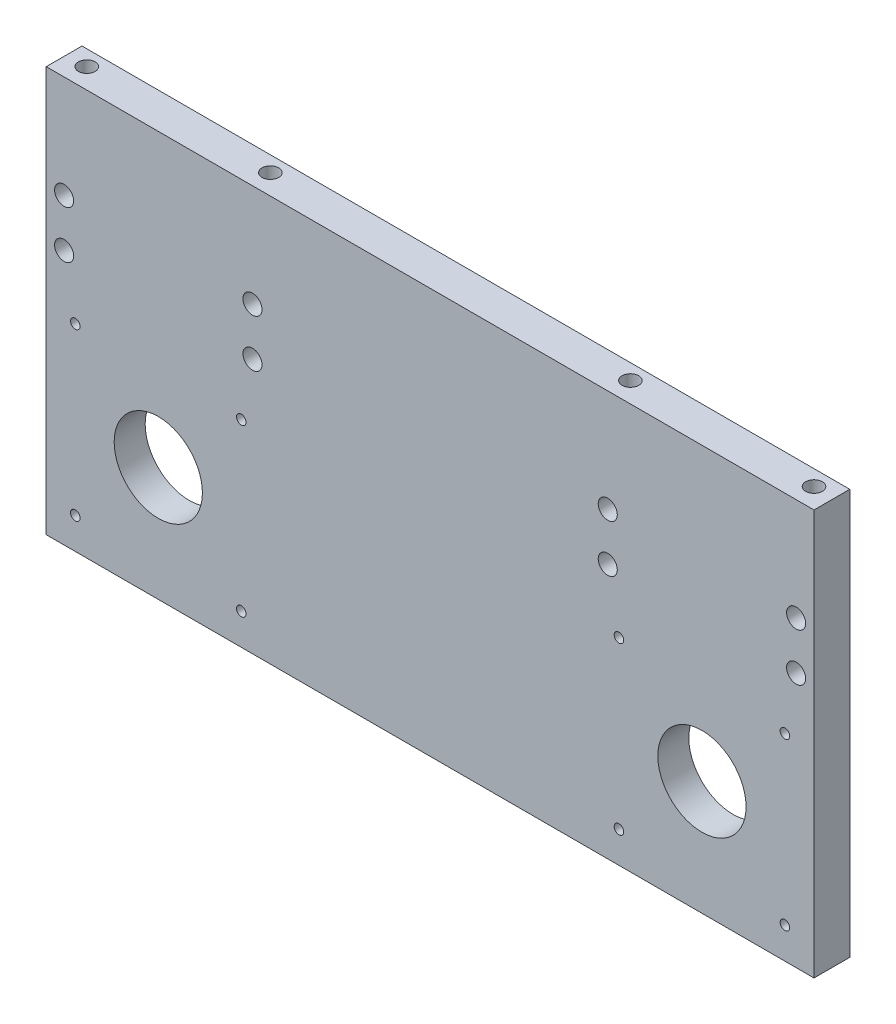
ISO-10303-21;
HEADER;
FILE_DESCRIPTION(('STEP AP214'),'2;1');
FILE_NAME('part.step','',(''),(''),'','','');
FILE_SCHEMA(('AUTOMOTIVE_DESIGN { 1 0 10303 214 1 1 1 1 }'));
ENDSEC;
DATA;
#1=APPLICATION_CONTEXT('core data for automotive mechanical design processes');
#2=APPLICATION_PROTOCOL_DEFINITION('international standard','automotive_design',2000,#1);
#3=PRODUCT_CONTEXT('',#1,'mechanical');
#4=PRODUCT('Part','Part','',(#3));
#5=PRODUCT_RELATED_PRODUCT_CATEGORY('part','',(#4));
#6=PRODUCT_DEFINITION_FORMATION('','',#4);
#7=PRODUCT_DEFINITION_CONTEXT('part definition',#1,'design');
#8=PRODUCT_DEFINITION('design','',#6,#7);
#9=PRODUCT_DEFINITION_SHAPE('','',#8);
#10=(LENGTH_UNIT() NAMED_UNIT(*) SI_UNIT(.MILLI.,.METRE.));
#11=(NAMED_UNIT(*) PLANE_ANGLE_UNIT() SI_UNIT($,.RADIAN.));
#12=(NAMED_UNIT(*) SI_UNIT($,.STERADIAN.) SOLID_ANGLE_UNIT());
#13=UNCERTAINTY_MEASURE_WITH_UNIT(LENGTH_MEASURE(1.E-05),#10,'distance_accuracy_value','');
#14=(GEOMETRIC_REPRESENTATION_CONTEXT(3) GLOBAL_UNCERTAINTY_ASSIGNED_CONTEXT((#13)) GLOBAL_UNIT_ASSIGNED_CONTEXT((#10,
#11,#12)) REPRESENTATION_CONTEXT('',''));
#15=CARTESIAN_POINT('',(0.,0.,0.));
#16=DIRECTION('',(0.,0.,1.));
#17=DIRECTION('',(1.,0.,0.));
#18=AXIS2_PLACEMENT_3D('',#15,#16,#17);
#19=CARTESIAN_POINT('',(-79.2,-2.27000000000004,-2.75));
#20=DIRECTION('',(0.,0.,1.));
#21=DIRECTION('',(1.,0.,0.));
#22=AXIS2_PLACEMENT_3D('',#19,#20,#21);
#23=CYLINDRICAL_SURFACE('',#22,2.);
#24=CARTESIAN_POINT('',(-79.2,-2.27000000000004,15.));
#25=DIRECTION('',(0.,0.,1.));
#26=DIRECTION('',(1.,0.,0.));
#27=AXIS2_PLACEMENT_3D('',#24,#25,#26);
#28=CIRCLE('',#27,2.);
#29=CARTESIAN_POINT('',(-77.2,-2.27000000000004,15.));
#30=VERTEX_POINT('',#29);
#31=EDGE_CURVE('E46',#30,#30,#28,.T.);
#32=ORIENTED_EDGE('',*,*,#31,.T.);
#33=EDGE_LOOP('',(#32));
#34=FACE_BOUND('',#33,.T.);
#35=CARTESIAN_POINT('',(-79.2,-2.27000000000004,0.));
#36=DIRECTION('',(0.,0.,1.));
#37=DIRECTION('',(1.,0.,0.));
#38=AXIS2_PLACEMENT_3D('',#35,#36,#37);
#39=CIRCLE('',#38,2.);
#40=CARTESIAN_POINT('',(-77.2,-2.27000000000004,0.));
#41=VERTEX_POINT('',#40);
#42=EDGE_CURVE('E11',#41,#41,#39,.T.);
#43=ORIENTED_EDGE('',*,*,#42,.F.);
#44=EDGE_LOOP('',(#43));
#45=FACE_BOUND('',#44,.T.);
#46=ADVANCED_FACE('F37',(#34,#45),#23,.F.);
#47=CARTESIAN_POINT('',(-148.8,-2.27000000000004,-2.75));
#48=DIRECTION('',(0.,0.,1.));
#49=DIRECTION('',(1.,0.,0.));
#50=AXIS2_PLACEMENT_3D('',#47,#48,#49);
#51=CYLINDRICAL_SURFACE('',#50,2.);
#52=CARTESIAN_POINT('',(-148.8,-2.27000000000004,15.));
#53=DIRECTION('',(0.,0.,1.));
#54=DIRECTION('',(1.,0.,0.));
#55=AXIS2_PLACEMENT_3D('',#52,#53,#54);
#56=CIRCLE('',#55,2.);
#57=CARTESIAN_POINT('',(-146.8,-2.27000000000004,15.));
#58=VERTEX_POINT('',#57);
#59=EDGE_CURVE('E246',#58,#58,#56,.T.);
#60=ORIENTED_EDGE('',*,*,#59,.T.);
#61=EDGE_LOOP('',(#60));
#62=FACE_BOUND('',#61,.T.);
#63=CARTESIAN_POINT('',(-148.8,-2.27000000000004,0.));
#64=DIRECTION('',(0.,0.,1.));
#65=DIRECTION('',(1.,0.,0.));
#66=AXIS2_PLACEMENT_3D('',#63,#64,#65);
#67=CIRCLE('',#66,2.);
#68=CARTESIAN_POINT('',(-146.8,-2.27000000000004,0.));
#69=VERTEX_POINT('',#68);
#70=EDGE_CURVE('E251',#69,#69,#67,.T.);
#71=ORIENTED_EDGE('',*,*,#70,.F.);
#72=EDGE_LOOP('',(#71));
#73=FACE_BOUND('',#72,.T.);
#74=ADVANCED_FACE('F287',(#62,#73),#51,.F.);
#75=CARTESIAN_POINT('',(-161.,-85.,15.));
#76=DIRECTION('',(1.,0.,0.));
#77=DIRECTION('',(0.,0.,-1.));
#78=AXIS2_PLACEMENT_3D('',#75,#76,#77);
#79=PLANE('',#78);
#80=DIRECTION('',(0.,-1.,0.));
#81=VECTOR('',#80,1.);
#82=CARTESIAN_POINT('',(-161.,-85.,0.));
#83=LINE('',#82,#81);
#84=CARTESIAN_POINT('',(-161.,85.,0.));
#85=VERTEX_POINT('',#84);
#86=CARTESIAN_POINT('',(-161.,-85.,0.));
#87=VERTEX_POINT('',#86);
#88=EDGE_CURVE('E232',#85,#87,#83,.T.);
#89=ORIENTED_EDGE('',*,*,#88,.T.);
#90=DIRECTION('',(0.,0.,-1.));
#91=VECTOR('',#90,1.);
#92=CARTESIAN_POINT('',(-161.,-85.,15.));
#93=LINE('',#92,#91);
#94=CARTESIAN_POINT('',(-161.,-85.,15.));
#95=VERTEX_POINT('',#94);
#96=EDGE_CURVE('E244',#95,#87,#93,.T.);
#97=ORIENTED_EDGE('',*,*,#96,.F.);
#98=DIRECTION('',(0.,-1.,0.));
#99=VECTOR('',#98,1.);
#100=CARTESIAN_POINT('',(-161.,-85.,15.));
#101=LINE('',#100,#99);
#102=CARTESIAN_POINT('',(-161.,85.,15.));
#103=VERTEX_POINT('',#102);
#104=EDGE_CURVE('E225',#103,#95,#101,.T.);
#105=ORIENTED_EDGE('',*,*,#104,.F.);
#106=DIRECTION('',(0.,0.,-1.));
#107=VECTOR('',#106,1.);
#108=CARTESIAN_POINT('',(-161.,85.,15.));
#109=LINE('',#108,#107);
#110=EDGE_CURVE('E231',#103,#85,#109,.T.);
#111=ORIENTED_EDGE('',*,*,#110,.T.);
#112=EDGE_LOOP('',(#89,#97,#105,#111));
#113=FACE_BOUND('',#112,.T.);
#114=ADVANCED_FACE('F292',(#113),#79,.F.);
#115=CARTESIAN_POINT('',(161.,-85.,15.));
#116=DIRECTION('',(0.,1.,0.));
#117=DIRECTION('',(-1.,0.,0.));
#118=AXIS2_PLACEMENT_3D('',#115,#116,#117);
#119=PLANE('',#118);
#120=DIRECTION('',(1.,0.,0.));
#121=VECTOR('',#120,1.);
#122=CARTESIAN_POINT('',(161.,-85.,0.));
#123=LINE('',#122,#121);
#124=CARTESIAN_POINT('',(161.,-85.,0.));
#125=VERTEX_POINT('',#124);
#126=EDGE_CURVE('E235',#87,#125,#123,.T.);
#127=ORIENTED_EDGE('',*,*,#126,.T.);
#128=DIRECTION('',(0.,0.,-1.));
#129=VECTOR('',#128,1.);
#130=CARTESIAN_POINT('',(161.,-85.,15.));
#131=LINE('',#130,#129);
#132=CARTESIAN_POINT('',(161.,-85.,15.));
#133=VERTEX_POINT('',#132);
#134=EDGE_CURVE('E242',#133,#125,#131,.T.);
#135=ORIENTED_EDGE('',*,*,#134,.F.);
#136=DIRECTION('',(1.,0.,0.));
#137=VECTOR('',#136,1.);
#138=CARTESIAN_POINT('',(161.,-85.,15.));
#139=LINE('',#138,#137);
#140=EDGE_CURVE('E87',#95,#133,#139,.T.);
#141=ORIENTED_EDGE('',*,*,#140,.F.);
#142=ORIENTED_EDGE('',*,*,#96,.T.);
#143=EDGE_LOOP('',(#127,#135,#141,#142));
#144=FACE_BOUND('',#143,.T.);
#145=ADVANCED_FACE('F321',(#144),#119,.F.);
#146=CARTESIAN_POINT('',(161.,-85.,15.));
#147=DIRECTION('',(-1.,0.,0.));
#148=DIRECTION('',(0.,0.,1.));
#149=AXIS2_PLACEMENT_3D('',#146,#147,#148);
#150=PLANE('',#149);
#151=DIRECTION('',(0.,1.,0.));
#152=VECTOR('',#151,1.);
#153=CARTESIAN_POINT('',(161.,-85.,0.));
#154=LINE('',#153,#152);
#155=CARTESIAN_POINT('',(161.,85.,0.));
#156=VERTEX_POINT('',#155);
#157=EDGE_CURVE('E73',#125,#156,#154,.T.);
#158=ORIENTED_EDGE('',*,*,#157,.T.);
#159=DIRECTION('',(0.,0.,-1.));
#160=VECTOR('',#159,1.);
#161=CARTESIAN_POINT('',(161.,85.,15.));
#162=LINE('',#161,#160);
#163=CARTESIAN_POINT('',(161.,85.,15.));
#164=VERTEX_POINT('',#163);
#165=EDGE_CURVE('E240',#164,#156,#162,.T.);
#166=ORIENTED_EDGE('',*,*,#165,.F.);
#167=DIRECTION('',(0.,1.,0.));
#168=VECTOR('',#167,1.);
#169=CARTESIAN_POINT('',(161.,-85.,15.));
#170=LINE('',#169,#168);
#171=EDGE_CURVE('E228',#133,#164,#170,.T.);
#172=ORIENTED_EDGE('',*,*,#171,.F.);
#173=ORIENTED_EDGE('',*,*,#134,.T.);
#174=EDGE_LOOP('',(#158,#166,#172,#173));
#175=FACE_BOUND('',#174,.T.);
#176=ADVANCED_FACE('F317',(#175),#150,.F.);
#177=CARTESIAN_POINT('',(161.,85.,15.));
#178=DIRECTION('',(0.,-1.,0.));
#179=DIRECTION('',(1.,0.,0.));
#180=AXIS2_PLACEMENT_3D('',#177,#178,#179);
#181=PLANE('',#180);
#182=CARTESIAN_POINT('',(-152.5,85.,6.5));
#183=DIRECTION('',(0.,1.,0.));
#184=DIRECTION('',(0.,0.,1.));
#185=AXIS2_PLACEMENT_3D('',#182,#183,#184);
#186=CIRCLE('',#185,3.5);
#187=CARTESIAN_POINT('',(-152.5,85.,10.));
#188=VERTEX_POINT('',#187);
#189=EDGE_CURVE('E111',#188,#188,#186,.T.);
#190=ORIENTED_EDGE('',*,*,#189,.F.);
#191=EDGE_LOOP('',(#190));
#192=FACE_BOUND('',#191,.T.);
#193=CARTESIAN_POINT('',(-75.5,85.,6.5));
#194=DIRECTION('',(0.,1.,0.));
#195=DIRECTION('',(0.,0.,1.));
#196=AXIS2_PLACEMENT_3D('',#193,#194,#195);
#197=CIRCLE('',#196,3.49999999999999);
#198=CARTESIAN_POINT('',(-75.5,85.,9.99999999999999));
#199=VERTEX_POINT('',#198);
#200=EDGE_CURVE('E110',#199,#199,#197,.T.);
#201=ORIENTED_EDGE('',*,*,#200,.F.);
#202=EDGE_LOOP('',(#201));
#203=FACE_BOUND('',#202,.T.);
#204=CARTESIAN_POINT('',(75.5,85.,6.5));
#205=DIRECTION('',(0.,1.,0.));
#206=DIRECTION('',(0.,0.,1.));
#207=AXIS2_PLACEMENT_3D('',#204,#205,#206);
#208=CIRCLE('',#207,3.49999999999999);
#209=CARTESIAN_POINT('',(75.5,85.,9.99999999999999));
#210=VERTEX_POINT('',#209);
#211=EDGE_CURVE('E121',#210,#210,#208,.T.);
#212=ORIENTED_EDGE('',*,*,#211,.F.);
#213=EDGE_LOOP('',(#212));
#214=FACE_BOUND('',#213,.T.);
#215=CARTESIAN_POINT('',(152.5,85.,6.5));
#216=DIRECTION('',(0.,1.,0.));
#217=DIRECTION('',(0.,0.,1.));
#218=AXIS2_PLACEMENT_3D('',#215,#216,#217);
#219=CIRCLE('',#218,3.5);
#220=CARTESIAN_POINT('',(152.5,85.,10.));
#221=VERTEX_POINT('',#220);
#222=EDGE_CURVE('E127',#221,#221,#219,.T.);
#223=ORIENTED_EDGE('',*,*,#222,.F.);
#224=EDGE_LOOP('',(#223));
#225=FACE_BOUND('',#224,.T.);
#226=DIRECTION('',(-1.,0.,0.));
#227=VECTOR('',#226,1.);
#228=CARTESIAN_POINT('',(161.,85.,0.));
#229=LINE('',#228,#227);
#230=EDGE_CURVE('E79',#156,#85,#229,.T.);
#231=ORIENTED_EDGE('',*,*,#230,.T.);
#232=ORIENTED_EDGE('',*,*,#110,.F.);
#233=DIRECTION('',(-1.,0.,0.));
#234=VECTOR('',#233,1.);
#235=CARTESIAN_POINT('',(161.,85.,15.));
#236=LINE('',#235,#234);
#237=EDGE_CURVE('E55',#164,#103,#236,.T.);
#238=ORIENTED_EDGE('',*,*,#237,.F.);
#239=ORIENTED_EDGE('',*,*,#165,.T.);
#240=EDGE_LOOP('',(#231,#232,#238,#239));
#241=FACE_BOUND('',#240,.T.);
#242=ADVANCED_FACE('F310',(#192,#203,#214,#225,#241),#181,.F.);
#243=CARTESIAN_POINT('',(0.,0.,15.));
#244=DIRECTION('',(0.,0.,1.));
#245=DIRECTION('',(1.,0.,0.));
#246=AXIS2_PLACEMENT_3D('',#243,#244,#245);
#247=PLANE('',#246);
#248=CARTESIAN_POINT('',(74.5,22.,15.));
#249=DIRECTION('',(0.,0.,1.));
#250=DIRECTION('',(1.,0.,0.));
#251=AXIS2_PLACEMENT_3D('',#248,#249,#250);
#252=CIRCLE('',#251,3.99999999999999);
#253=CARTESIAN_POINT('',(78.5,22.,15.));
#254=VERTEX_POINT('',#253);
#255=EDGE_CURVE('E144',#254,#254,#252,.T.);
#256=ORIENTED_EDGE('',*,*,#255,.F.);
#257=EDGE_LOOP('',(#256));
#258=FACE_BOUND('',#257,.T.);
#259=CARTESIAN_POINT('',(153.5,42.,15.));
#260=DIRECTION('',(0.,0.,1.));
#261=DIRECTION('',(1.,0.,0.));
#262=AXIS2_PLACEMENT_3D('',#259,#260,#261);
#263=CIRCLE('',#262,3.99999999999999);
#264=CARTESIAN_POINT('',(157.5,42.,15.));
#265=VERTEX_POINT('',#264);
#266=EDGE_CURVE('E137',#265,#265,#263,.T.);
#267=ORIENTED_EDGE('',*,*,#266,.F.);
#268=EDGE_LOOP('',(#267));
#269=FACE_BOUND('',#268,.T.);
#270=CARTESIAN_POINT('',(153.5,22.,15.));
#271=DIRECTION('',(0.,0.,1.));
#272=DIRECTION('',(1.,0.,0.));
#273=AXIS2_PLACEMENT_3D('',#270,#271,#272);
#274=CIRCLE('',#273,3.99999999999999);
#275=CARTESIAN_POINT('',(157.5,22.,15.));
#276=VERTEX_POINT('',#275);
#277=EDGE_CURVE('E133',#276,#276,#274,.T.);
#278=ORIENTED_EDGE('',*,*,#277,.F.);
#279=EDGE_LOOP('',(#278));
#280=FACE_BOUND('',#279,.T.);
#281=CARTESIAN_POINT('',(74.5,42.,15.));
#282=DIRECTION('',(0.,0.,1.));
#283=DIRECTION('',(1.,0.,0.));
#284=AXIS2_PLACEMENT_3D('',#281,#282,#283);
#285=CIRCLE('',#284,3.99999999999999);
#286=CARTESIAN_POINT('',(78.5,42.,15.));
#287=VERTEX_POINT('',#286);
#288=EDGE_CURVE('E143',#287,#287,#285,.T.);
#289=ORIENTED_EDGE('',*,*,#288,.F.);
#290=EDGE_LOOP('',(#289));
#291=FACE_BOUND('',#290,.T.);
#292=CARTESIAN_POINT('',(114.,-37.07,15.));
#293=DIRECTION('',(0.,0.,1.));
#294=DIRECTION('',(1.,0.,0.));
#295=AXIS2_PLACEMENT_3D('',#292,#293,#294);
#296=CIRCLE('',#295,18.5);
#297=CARTESIAN_POINT('',(132.5,-37.07,15.));
#298=VERTEX_POINT('',#297);
#299=EDGE_CURVE('E40',#298,#298,#296,.T.);
#300=ORIENTED_EDGE('',*,*,#299,.F.);
#301=EDGE_LOOP('',(#300));
#302=FACE_BOUND('',#301,.T.);
#303=CARTESIAN_POINT('',(79.2,-2.27000000000002,15.));
#304=DIRECTION('',(0.,0.,1.));
#305=DIRECTION('',(1.,0.,0.));
#306=AXIS2_PLACEMENT_3D('',#303,#304,#305);
#307=CIRCLE('',#306,2.);
#308=CARTESIAN_POINT('',(81.2,-2.27000000000002,15.));
#309=VERTEX_POINT('',#308);
#310=EDGE_CURVE('E167',#309,#309,#307,.T.);
#311=ORIENTED_EDGE('',*,*,#310,.F.);
#312=EDGE_LOOP('',(#311));
#313=FACE_BOUND('',#312,.T.);
#314=CARTESIAN_POINT('',(148.8,-71.87,15.));
#315=DIRECTION('',(0.,0.,1.));
#316=DIRECTION('',(1.,0.,0.));
#317=AXIS2_PLACEMENT_3D('',#314,#315,#316);
#318=CIRCLE('',#317,2.);
#319=CARTESIAN_POINT('',(150.8,-71.87,15.));
#320=VERTEX_POINT('',#319);
#321=EDGE_CURVE('E171',#320,#320,#318,.T.);
#322=ORIENTED_EDGE('',*,*,#321,.F.);
#323=EDGE_LOOP('',(#322));
#324=FACE_BOUND('',#323,.T.);
#325=CARTESIAN_POINT('',(148.8,-2.27000000000002,15.));
#326=DIRECTION('',(0.,0.,1.));
#327=DIRECTION('',(1.,0.,0.));
#328=AXIS2_PLACEMENT_3D('',#325,#326,#327);
#329=CIRCLE('',#328,2.);
#330=CARTESIAN_POINT('',(150.8,-2.27000000000002,15.));
#331=VERTEX_POINT('',#330);
#332=EDGE_CURVE('E163',#331,#331,#329,.T.);
#333=ORIENTED_EDGE('',*,*,#332,.F.);
#334=EDGE_LOOP('',(#333));
#335=FACE_BOUND('',#334,.T.);
#336=CARTESIAN_POINT('',(79.2,-71.87,15.));
#337=DIRECTION('',(0.,0.,1.));
#338=DIRECTION('',(1.,0.,0.));
#339=AXIS2_PLACEMENT_3D('',#336,#337,#338);
#340=CIRCLE('',#339,2.);
#341=CARTESIAN_POINT('',(81.2,-71.87,15.));
#342=VERTEX_POINT('',#341);
#343=EDGE_CURVE('E176',#342,#342,#340,.T.);
#344=ORIENTED_EDGE('',*,*,#343,.F.);
#345=EDGE_LOOP('',(#344));
#346=FACE_BOUND('',#345,.T.);
#347=CARTESIAN_POINT('',(-74.5,42.,15.));
#348=DIRECTION('',(0.,0.,1.));
#349=DIRECTION('',(1.,0.,0.));
#350=AXIS2_PLACEMENT_3D('',#347,#348,#349);
#351=CIRCLE('',#350,3.99999999999999);
#352=CARTESIAN_POINT('',(-70.5,42.,15.));
#353=VERTEX_POINT('',#352);
#354=EDGE_CURVE('E185',#353,#353,#351,.T.);
#355=ORIENTED_EDGE('',*,*,#354,.F.);
#356=EDGE_LOOP('',(#355));
#357=FACE_BOUND('',#356,.T.);
#358=CARTESIAN_POINT('',(-74.5,22.,15.));
#359=DIRECTION('',(0.,0.,1.));
#360=DIRECTION('',(1.,0.,0.));
#361=AXIS2_PLACEMENT_3D('',#358,#359,#360);
#362=CIRCLE('',#361,3.99999999999999);
#363=CARTESIAN_POINT('',(-70.5,22.,15.));
#364=VERTEX_POINT('',#363);
#365=EDGE_CURVE('E191',#364,#364,#362,.T.);
#366=ORIENTED_EDGE('',*,*,#365,.F.);
#367=EDGE_LOOP('',(#366));
#368=FACE_BOUND('',#367,.T.);
#369=CARTESIAN_POINT('',(-153.5,42.,15.));
#370=DIRECTION('',(0.,0.,1.));
#371=DIRECTION('',(1.,0.,0.));
#372=AXIS2_PLACEMENT_3D('',#369,#370,#371);
#373=CIRCLE('',#372,3.99999999999999);
#374=CARTESIAN_POINT('',(-149.5,42.,15.));
#375=VERTEX_POINT('',#374);
#376=EDGE_CURVE('E198',#375,#375,#373,.T.);
#377=ORIENTED_EDGE('',*,*,#376,.F.);
#378=EDGE_LOOP('',(#377));
#379=FACE_BOUND('',#378,.T.);
#380=CARTESIAN_POINT('',(-153.5,22.,15.));
#381=DIRECTION('',(0.,0.,1.));
#382=DIRECTION('',(1.,0.,0.));
#383=AXIS2_PLACEMENT_3D('',#380,#381,#382);
#384=CIRCLE('',#383,3.99999999999999);
#385=CARTESIAN_POINT('',(-149.5,22.,15.));
#386=VERTEX_POINT('',#385);
#387=EDGE_CURVE('E184',#386,#386,#384,.T.);
#388=ORIENTED_EDGE('',*,*,#387,.F.);
#389=EDGE_LOOP('',(#388));
#390=FACE_BOUND('',#389,.T.);
#391=CARTESIAN_POINT('',(-114.,-37.07,15.));
#392=DIRECTION('',(0.,0.,1.));
#393=DIRECTION('',(1.,0.,0.));
#394=AXIS2_PLACEMENT_3D('',#391,#392,#393);
#395=CIRCLE('',#394,18.5);
#396=CARTESIAN_POINT('',(-95.5000000000001,-37.07,15.));
#397=VERTEX_POINT('',#396);
#398=EDGE_CURVE('E208',#397,#397,#395,.T.);
#399=ORIENTED_EDGE('',*,*,#398,.F.);
#400=EDGE_LOOP('',(#399));
#401=FACE_BOUND('',#400,.T.);
#402=CARTESIAN_POINT('',(-79.2,-71.87,15.));
#403=DIRECTION('',(0.,0.,1.));
#404=DIRECTION('',(1.,0.,0.));
#405=AXIS2_PLACEMENT_3D('',#402,#403,#404);
#406=CIRCLE('',#405,2.);
#407=CARTESIAN_POINT('',(-77.2,-71.87,15.));
#408=VERTEX_POINT('',#407);
#409=EDGE_CURVE('E212',#408,#408,#406,.T.);
#410=ORIENTED_EDGE('',*,*,#409,.F.);
#411=EDGE_LOOP('',(#410));
#412=FACE_BOUND('',#411,.T.);
#413=CARTESIAN_POINT('',(-148.8,-71.87,15.));
#414=DIRECTION('',(0.,0.,1.));
#415=DIRECTION('',(1.,0.,0.));
#416=AXIS2_PLACEMENT_3D('',#413,#414,#415);
#417=CIRCLE('',#416,2.);
#418=CARTESIAN_POINT('',(-146.8,-71.87,15.));
#419=VERTEX_POINT('',#418);
#420=EDGE_CURVE('E221',#419,#419,#417,.T.);
#421=ORIENTED_EDGE('',*,*,#420,.F.);
#422=EDGE_LOOP('',(#421));
#423=FACE_BOUND('',#422,.T.);
#424=ORIENTED_EDGE('',*,*,#104,.T.);
#425=ORIENTED_EDGE('',*,*,#140,.T.);
#426=ORIENTED_EDGE('',*,*,#171,.T.);
#427=ORIENTED_EDGE('',*,*,#237,.T.);
#428=EDGE_LOOP('',(#424,#425,#426,#427));
#429=FACE_BOUND('',#428,.T.);
#430=ORIENTED_EDGE('',*,*,#59,.F.);
#431=EDGE_LOOP('',(#430));
#432=FACE_BOUND('',#431,.T.);
#433=ORIENTED_EDGE('',*,*,#31,.F.);
#434=EDGE_LOOP('',(#433));
#435=FACE_BOUND('',#434,.T.);
#436=ADVANCED_FACE('F300',(#258,#269,#280,#291,#302,#313,#324,#335,#346,#357,#368,#379,#390,
#401,#412,#423,#429,#432,#435),#247,.T.);
#437=CARTESIAN_POINT('',(0.,0.,0.));
#438=DIRECTION('',(0.,0.,1.));
#439=DIRECTION('',(1.,0.,0.));
#440=AXIS2_PLACEMENT_3D('',#437,#438,#439);
#441=PLANE('',#440);
#442=CARTESIAN_POINT('',(74.5,22.,0.));
#443=DIRECTION('',(0.,0.,1.));
#444=DIRECTION('',(1.,0.,0.));
#445=AXIS2_PLACEMENT_3D('',#442,#443,#444);
#446=CIRCLE('',#445,3.99999999999999);
#447=CARTESIAN_POINT('',(78.5,22.,0.));
#448=VERTEX_POINT('',#447);
#449=EDGE_CURVE('E140',#448,#448,#446,.T.);
#450=ORIENTED_EDGE('',*,*,#449,.T.);
#451=EDGE_LOOP('',(#450));
#452=FACE_BOUND('',#451,.T.);
#453=CARTESIAN_POINT('',(153.5,42.,0.));
#454=DIRECTION('',(0.,0.,1.));
#455=DIRECTION('',(1.,0.,0.));
#456=AXIS2_PLACEMENT_3D('',#453,#454,#455);
#457=CIRCLE('',#456,3.99999999999999);
#458=CARTESIAN_POINT('',(157.5,42.,0.));
#459=VERTEX_POINT('',#458);
#460=EDGE_CURVE('E147',#459,#459,#457,.T.);
#461=ORIENTED_EDGE('',*,*,#460,.T.);
#462=EDGE_LOOP('',(#461));
#463=FACE_BOUND('',#462,.T.);
#464=CARTESIAN_POINT('',(153.5,22.,0.));
#465=DIRECTION('',(0.,0.,1.));
#466=DIRECTION('',(1.,0.,0.));
#467=AXIS2_PLACEMENT_3D('',#464,#465,#466);
#468=CIRCLE('',#467,3.99999999999999);
#469=CARTESIAN_POINT('',(157.5,22.,0.));
#470=VERTEX_POINT('',#469);
#471=EDGE_CURVE('E134',#470,#470,#468,.T.);
#472=ORIENTED_EDGE('',*,*,#471,.T.);
#473=EDGE_LOOP('',(#472));
#474=FACE_BOUND('',#473,.T.);
#475=CARTESIAN_POINT('',(74.5,42.,0.));
#476=DIRECTION('',(0.,0.,1.));
#477=DIRECTION('',(1.,0.,0.));
#478=AXIS2_PLACEMENT_3D('',#475,#476,#477);
#479=CIRCLE('',#478,3.99999999999999);
#480=CARTESIAN_POINT('',(78.5,42.,0.));
#481=VERTEX_POINT('',#480);
#482=EDGE_CURVE('E152',#481,#481,#479,.T.);
#483=ORIENTED_EDGE('',*,*,#482,.T.);
#484=EDGE_LOOP('',(#483));
#485=FACE_BOUND('',#484,.T.);
#486=CARTESIAN_POINT('',(114.,-37.07,0.));
#487=DIRECTION('',(0.,0.,-1.));
#488=DIRECTION('',(-1.,0.,0.));
#489=AXIS2_PLACEMENT_3D('',#486,#487,#488);
#490=CIRCLE('',#489,37.5);
#491=CARTESIAN_POINT('',(76.5,-37.07,0.));
#492=VERTEX_POINT('',#491);
#493=EDGE_CURVE('E164',#492,#492,#490,.T.);
#494=ORIENTED_EDGE('',*,*,#493,.F.);
#495=EDGE_LOOP('',(#494));
#496=FACE_BOUND('',#495,.T.);
#497=CARTESIAN_POINT('',(79.2,-2.27000000000002,0.));
#498=DIRECTION('',(0.,0.,1.));
#499=DIRECTION('',(1.,0.,0.));
#500=AXIS2_PLACEMENT_3D('',#497,#498,#499);
#501=CIRCLE('',#500,2.);
#502=CARTESIAN_POINT('',(81.2,-2.27000000000002,0.));
#503=VERTEX_POINT('',#502);
#504=EDGE_CURVE('E180',#503,#503,#501,.T.);
#505=ORIENTED_EDGE('',*,*,#504,.T.);
#506=EDGE_LOOP('',(#505));
#507=FACE_BOUND('',#506,.T.);
#508=CARTESIAN_POINT('',(148.8,-71.87,0.));
#509=DIRECTION('',(0.,0.,1.));
#510=DIRECTION('',(1.,0.,0.));
#511=AXIS2_PLACEMENT_3D('',#508,#509,#510);
#512=CIRCLE('',#511,2.);
#513=CARTESIAN_POINT('',(150.8,-71.87,0.));
#514=VERTEX_POINT('',#513);
#515=EDGE_CURVE('E262',#514,#514,#512,.T.);
#516=ORIENTED_EDGE('',*,*,#515,.T.);
#517=EDGE_LOOP('',(#516));
#518=FACE_BOUND('',#517,.T.);
#519=CARTESIAN_POINT('',(148.8,-2.27000000000002,0.));
#520=DIRECTION('',(0.,0.,1.));
#521=DIRECTION('',(1.,0.,0.));
#522=AXIS2_PLACEMENT_3D('',#519,#520,#521);
#523=CIRCLE('',#522,2.);
#524=CARTESIAN_POINT('',(150.8,-2.27000000000002,0.));
#525=VERTEX_POINT('',#524);
#526=EDGE_CURVE('E170',#525,#525,#523,.T.);
#527=ORIENTED_EDGE('',*,*,#526,.T.);
#528=EDGE_LOOP('',(#527));
#529=FACE_BOUND('',#528,.T.);
#530=CARTESIAN_POINT('',(79.2,-71.87,0.));
#531=DIRECTION('',(0.,0.,1.));
#532=DIRECTION('',(1.,0.,0.));
#533=AXIS2_PLACEMENT_3D('',#530,#531,#532);
#534=CIRCLE('',#533,2.);
#535=CARTESIAN_POINT('',(81.2,-71.87,0.));
#536=VERTEX_POINT('',#535);
#537=EDGE_CURVE('E179',#536,#536,#534,.T.);
#538=ORIENTED_EDGE('',*,*,#537,.T.);
#539=EDGE_LOOP('',(#538));
#540=FACE_BOUND('',#539,.T.);
#541=CARTESIAN_POINT('',(-74.5,42.,0.));
#542=DIRECTION('',(0.,0.,1.));
#543=DIRECTION('',(1.,0.,0.));
#544=AXIS2_PLACEMENT_3D('',#541,#542,#543);
#545=CIRCLE('',#544,3.99999999999999);
#546=CARTESIAN_POINT('',(-70.5,42.,0.));
#547=VERTEX_POINT('',#546);
#548=EDGE_CURVE('E181',#547,#547,#545,.T.);
#549=ORIENTED_EDGE('',*,*,#548,.T.);
#550=EDGE_LOOP('',(#549));
#551=FACE_BOUND('',#550,.T.);
#552=CARTESIAN_POINT('',(-74.5,22.,0.));
#553=DIRECTION('',(0.,0.,1.));
#554=DIRECTION('',(1.,0.,0.));
#555=AXIS2_PLACEMENT_3D('',#552,#553,#554);
#556=CIRCLE('',#555,3.99999999999999);
#557=CARTESIAN_POINT('',(-70.5,22.,0.));
#558=VERTEX_POINT('',#557);
#559=EDGE_CURVE('E188',#558,#558,#556,.T.);
#560=ORIENTED_EDGE('',*,*,#559,.T.);
#561=EDGE_LOOP('',(#560));
#562=FACE_BOUND('',#561,.T.);
#563=CARTESIAN_POINT('',(-153.5,42.,0.));
#564=DIRECTION('',(0.,0.,1.));
#565=DIRECTION('',(1.,0.,0.));
#566=AXIS2_PLACEMENT_3D('',#563,#564,#565);
#567=CIRCLE('',#566,3.99999999999999);
#568=CARTESIAN_POINT('',(-149.5,42.,0.));
#569=VERTEX_POINT('',#568);
#570=EDGE_CURVE('E194',#569,#569,#567,.T.);
#571=ORIENTED_EDGE('',*,*,#570,.T.);
#572=EDGE_LOOP('',(#571));
#573=FACE_BOUND('',#572,.T.);
#574=CARTESIAN_POINT('',(-153.5,22.,0.));
#575=DIRECTION('',(0.,0.,1.));
#576=DIRECTION('',(1.,0.,0.));
#577=AXIS2_PLACEMENT_3D('',#574,#575,#576);
#578=CIRCLE('',#577,3.99999999999999);
#579=CARTESIAN_POINT('',(-149.5,22.,0.));
#580=VERTEX_POINT('',#579);
#581=EDGE_CURVE('E201',#580,#580,#578,.T.);
#582=ORIENTED_EDGE('',*,*,#581,.T.);
#583=EDGE_LOOP('',(#582));
#584=FACE_BOUND('',#583,.T.);
#585=CARTESIAN_POINT('',(-114.,-37.07,0.));
#586=DIRECTION('',(0.,0.,-1.));
#587=DIRECTION('',(-1.,0.,0.));
#588=AXIS2_PLACEMENT_3D('',#585,#586,#587);
#589=CIRCLE('',#588,37.5);
#590=CARTESIAN_POINT('',(-151.5,-37.07,0.));
#591=VERTEX_POINT('',#590);
#592=EDGE_CURVE('E213',#591,#591,#589,.T.);
#593=ORIENTED_EDGE('',*,*,#592,.F.);
#594=EDGE_LOOP('',(#593));
#595=FACE_BOUND('',#594,.T.);
#596=CARTESIAN_POINT('',(-79.2,-71.87,0.));
#597=DIRECTION('',(0.,0.,1.));
#598=DIRECTION('',(1.,0.,0.));
#599=AXIS2_PLACEMENT_3D('',#596,#597,#598);
#600=CIRCLE('',#599,2.);
#601=CARTESIAN_POINT('',(-77.2,-71.87,0.));
#602=VERTEX_POINT('',#601);
#603=EDGE_CURVE('E218',#602,#602,#600,.T.);
#604=ORIENTED_EDGE('',*,*,#603,.T.);
#605=EDGE_LOOP('',(#604));
#606=FACE_BOUND('',#605,.T.);
#607=CARTESIAN_POINT('',(-148.8,-71.87,0.));
#608=DIRECTION('',(0.,0.,1.));
#609=DIRECTION('',(1.,0.,0.));
#610=AXIS2_PLACEMENT_3D('',#607,#608,#609);
#611=CIRCLE('',#610,2.);
#612=CARTESIAN_POINT('',(-146.8,-71.87,0.));
#613=VERTEX_POINT('',#612);
#614=EDGE_CURVE('E224',#613,#613,#611,.T.);
#615=ORIENTED_EDGE('',*,*,#614,.T.);
#616=EDGE_LOOP('',(#615));
#617=FACE_BOUND('',#616,.T.);
#618=ORIENTED_EDGE('',*,*,#88,.F.);
#619=ORIENTED_EDGE('',*,*,#230,.F.);
#620=ORIENTED_EDGE('',*,*,#157,.F.);
#621=ORIENTED_EDGE('',*,*,#126,.F.);
#622=EDGE_LOOP('',(#618,#619,#620,#621));
#623=FACE_BOUND('',#622,.T.);
#624=ORIENTED_EDGE('',*,*,#70,.T.);
#625=EDGE_LOOP('',(#624));
#626=FACE_BOUND('',#625,.T.);
#627=ORIENTED_EDGE('',*,*,#42,.T.);
#628=EDGE_LOOP('',(#627));
#629=FACE_BOUND('',#628,.T.);
#630=ADVANCED_FACE('F267',(#452,#463,#474,#485,#496,#507,#518,#529,#540,#551,#562,#573,#584,
#595,#606,#617,#623,#626,#629),#441,.F.);
#631=CARTESIAN_POINT('',(-148.8,-71.87,-2.75));
#632=DIRECTION('',(0.,0.,1.));
#633=DIRECTION('',(1.,0.,0.));
#634=AXIS2_PLACEMENT_3D('',#631,#632,#633);
#635=CYLINDRICAL_SURFACE('',#634,2.);
#636=ORIENTED_EDGE('',*,*,#420,.T.);
#637=EDGE_LOOP('',(#636));
#638=FACE_BOUND('',#637,.T.);
#639=ORIENTED_EDGE('',*,*,#614,.F.);
#640=EDGE_LOOP('',(#639));
#641=FACE_BOUND('',#640,.T.);
#642=ADVANCED_FACE('F299',(#638,#641),#635,.F.);
#643=CARTESIAN_POINT('',(-79.2,-71.87,-2.75));
#644=DIRECTION('',(0.,0.,1.));
#645=DIRECTION('',(1.,0.,0.));
#646=AXIS2_PLACEMENT_3D('',#643,#644,#645);
#647=CYLINDRICAL_SURFACE('',#646,2.);
#648=ORIENTED_EDGE('',*,*,#409,.T.);
#649=EDGE_LOOP('',(#648));
#650=FACE_BOUND('',#649,.T.);
#651=ORIENTED_EDGE('',*,*,#603,.F.);
#652=EDGE_LOOP('',(#651));
#653=FACE_BOUND('',#652,.T.);
#654=ADVANCED_FACE('F307',(#650,#653),#647,.F.);
#655=CARTESIAN_POINT('',(-114.,-37.07,2.));
#656=DIRECTION('',(0.,0.,-1.));
#657=DIRECTION('',(-1.,0.,0.));
#658=AXIS2_PLACEMENT_3D('',#655,#656,#657);
#659=CYLINDRICAL_SURFACE('',#658,37.5);
#660=CARTESIAN_POINT('',(-114.,-37.07,2.));
#661=DIRECTION('',(0.,0.,-1.));
#662=DIRECTION('',(-1.,0.,0.));
#663=AXIS2_PLACEMENT_3D('',#660,#661,#662);
#664=CIRCLE('',#663,37.5);
#665=CARTESIAN_POINT('',(-151.5,-37.07,2.));
#666=VERTEX_POINT('',#665);
#667=EDGE_CURVE('E209',#666,#666,#664,.T.);
#668=ORIENTED_EDGE('',*,*,#667,.F.);
#669=EDGE_LOOP('',(#668));
#670=FACE_BOUND('',#669,.T.);
#671=ORIENTED_EDGE('',*,*,#592,.T.);
#672=EDGE_LOOP('',(#671));
#673=FACE_BOUND('',#672,.T.);
#674=ADVANCED_FACE('F615',(#670,#673),#659,.F.);
#675=CARTESIAN_POINT('',(0.,0.,2.));
#676=DIRECTION('',(0.,0.,-1.));
#677=DIRECTION('',(-1.,0.,0.));
#678=AXIS2_PLACEMENT_3D('',#675,#676,#677);
#679=PLANE('',#678);
#680=CARTESIAN_POINT('',(-114.,-37.07,2.));
#681=DIRECTION('',(0.,0.,-1.));
#682=DIRECTION('',(-1.,0.,0.));
#683=AXIS2_PLACEMENT_3D('',#680,#681,#682);
#684=CIRCLE('',#683,18.5);
#685=CARTESIAN_POINT('',(-132.5,-37.07,2.));
#686=VERTEX_POINT('',#685);
#687=EDGE_CURVE('E197',#686,#686,#684,.T.);
#688=ORIENTED_EDGE('',*,*,#687,.F.);
#689=EDGE_LOOP('',(#688));
#690=FACE_BOUND('',#689,.T.);
#691=ORIENTED_EDGE('',*,*,#667,.T.);
#692=EDGE_LOOP('',(#691));
#693=FACE_BOUND('',#692,.T.);
#694=ADVANCED_FACE('F622',(#690,#693),#679,.T.);
#695=CARTESIAN_POINT('',(-114.,-37.07,19.75));
#696=DIRECTION('',(0.,0.,-1.));
#697=DIRECTION('',(-1.,0.,0.));
#698=AXIS2_PLACEMENT_3D('',#695,#696,#697);
#699=CYLINDRICAL_SURFACE('',#698,18.5);
#700=ORIENTED_EDGE('',*,*,#398,.T.);
#701=EDGE_LOOP('',(#700));
#702=FACE_BOUND('',#701,.T.);
#703=ORIENTED_EDGE('',*,*,#687,.T.);
#704=EDGE_LOOP('',(#703));
#705=FACE_BOUND('',#704,.T.);
#706=ADVANCED_FACE('F628',(#702,#705),#699,.F.);
#707=CARTESIAN_POINT('',(-153.5,22.,0.));
#708=DIRECTION('',(0.,0.,1.));
#709=DIRECTION('',(1.,0.,0.));
#710=AXIS2_PLACEMENT_3D('',#707,#708,#709);
#711=CYLINDRICAL_SURFACE('',#710,3.99999999999999);
#712=ORIENTED_EDGE('',*,*,#581,.F.);
#713=EDGE_LOOP('',(#712));
#714=FACE_BOUND('',#713,.T.);
#715=ORIENTED_EDGE('',*,*,#387,.T.);
#716=EDGE_LOOP('',(#715));
#717=FACE_BOUND('',#716,.T.);
#718=ADVANCED_FACE('F632',(#714,#717),#711,.F.);
#719=CARTESIAN_POINT('',(-153.5,42.,0.));
#720=DIRECTION('',(0.,0.,1.));
#721=DIRECTION('',(1.,0.,0.));
#722=AXIS2_PLACEMENT_3D('',#719,#720,#721);
#723=CYLINDRICAL_SURFACE('',#722,3.99999999999999);
#724=ORIENTED_EDGE('',*,*,#570,.F.);
#725=EDGE_LOOP('',(#724));
#726=FACE_BOUND('',#725,.T.);
#727=ORIENTED_EDGE('',*,*,#376,.T.);
#728=EDGE_LOOP('',(#727));
#729=FACE_BOUND('',#728,.T.);
#730=ADVANCED_FACE('F636',(#726,#729),#723,.F.);
#731=CARTESIAN_POINT('',(-74.5,22.,0.));
#732=DIRECTION('',(0.,0.,1.));
#733=DIRECTION('',(1.,0.,0.));
#734=AXIS2_PLACEMENT_3D('',#731,#732,#733);
#735=CYLINDRICAL_SURFACE('',#734,3.99999999999999);
#736=ORIENTED_EDGE('',*,*,#559,.F.);
#737=EDGE_LOOP('',(#736));
#738=FACE_BOUND('',#737,.T.);
#739=ORIENTED_EDGE('',*,*,#365,.T.);
#740=EDGE_LOOP('',(#739));
#741=FACE_BOUND('',#740,.T.);
#742=ADVANCED_FACE('F640',(#738,#741),#735,.F.);
#743=CARTESIAN_POINT('',(-74.5,42.,0.));
#744=DIRECTION('',(0.,0.,1.));
#745=DIRECTION('',(1.,0.,0.));
#746=AXIS2_PLACEMENT_3D('',#743,#744,#745);
#747=CYLINDRICAL_SURFACE('',#746,3.99999999999999);
#748=ORIENTED_EDGE('',*,*,#548,.F.);
#749=EDGE_LOOP('',(#748));
#750=FACE_BOUND('',#749,.T.);
#751=ORIENTED_EDGE('',*,*,#354,.T.);
#752=EDGE_LOOP('',(#751));
#753=FACE_BOUND('',#752,.T.);
#754=ADVANCED_FACE('F366',(#750,#753),#747,.F.);
#755=CARTESIAN_POINT('',(79.2,-71.87,-2.75));
#756=DIRECTION('',(0.,0.,1.));
#757=DIRECTION('',(1.,0.,0.));
#758=AXIS2_PLACEMENT_3D('',#755,#756,#757);
#759=CYLINDRICAL_SURFACE('',#758,2.);
#760=ORIENTED_EDGE('',*,*,#343,.T.);
#761=EDGE_LOOP('',(#760));
#762=FACE_BOUND('',#761,.T.);
#763=ORIENTED_EDGE('',*,*,#537,.F.);
#764=EDGE_LOOP('',(#763));
#765=FACE_BOUND('',#764,.T.);
#766=ADVANCED_FACE('F376',(#762,#765),#759,.F.);
#767=CARTESIAN_POINT('',(148.8,-2.27000000000002,-2.75));
#768=DIRECTION('',(0.,0.,1.));
#769=DIRECTION('',(1.,0.,0.));
#770=AXIS2_PLACEMENT_3D('',#767,#768,#769);
#771=CYLINDRICAL_SURFACE('',#770,2.);
#772=ORIENTED_EDGE('',*,*,#332,.T.);
#773=EDGE_LOOP('',(#772));
#774=FACE_BOUND('',#773,.T.);
#775=ORIENTED_EDGE('',*,*,#526,.F.);
#776=EDGE_LOOP('',(#775));
#777=FACE_BOUND('',#776,.T.);
#778=ADVANCED_FACE('F283',(#774,#777),#771,.F.);
#779=CARTESIAN_POINT('',(148.8,-71.87,-2.75));
#780=DIRECTION('',(0.,0.,1.));
#781=DIRECTION('',(1.,0.,0.));
#782=AXIS2_PLACEMENT_3D('',#779,#780,#781);
#783=CYLINDRICAL_SURFACE('',#782,2.);
#784=ORIENTED_EDGE('',*,*,#321,.T.);
#785=EDGE_LOOP('',(#784));
#786=FACE_BOUND('',#785,.T.);
#787=ORIENTED_EDGE('',*,*,#515,.F.);
#788=EDGE_LOOP('',(#787));
#789=FACE_BOUND('',#788,.T.);
#790=ADVANCED_FACE('F273',(#786,#789),#783,.F.);
#791=CARTESIAN_POINT('',(79.2,-2.27000000000002,-2.75));
#792=DIRECTION('',(0.,0.,1.));
#793=DIRECTION('',(1.,0.,0.));
#794=AXIS2_PLACEMENT_3D('',#791,#792,#793);
#795=CYLINDRICAL_SURFACE('',#794,2.);
#796=ORIENTED_EDGE('',*,*,#310,.T.);
#797=EDGE_LOOP('',(#796));
#798=FACE_BOUND('',#797,.T.);
#799=ORIENTED_EDGE('',*,*,#504,.F.);
#800=EDGE_LOOP('',(#799));
#801=FACE_BOUND('',#800,.T.);
#802=ADVANCED_FACE('F270',(#798,#801),#795,.F.);
#803=CARTESIAN_POINT('',(114.,-37.07,2.));
#804=DIRECTION('',(0.,0.,-1.));
#805=DIRECTION('',(-1.,0.,0.));
#806=AXIS2_PLACEMENT_3D('',#803,#804,#805);
#807=CYLINDRICAL_SURFACE('',#806,37.5);
#808=CARTESIAN_POINT('',(114.,-37.07,2.));
#809=DIRECTION('',(0.,0.,-1.));
#810=DIRECTION('',(-1.,0.,0.));
#811=AXIS2_PLACEMENT_3D('',#808,#809,#810);
#812=CIRCLE('',#811,37.5);
#813=CARTESIAN_POINT('',(76.5,-37.07,2.));
#814=VERTEX_POINT('',#813);
#815=EDGE_CURVE('E160',#814,#814,#812,.T.);
#816=ORIENTED_EDGE('',*,*,#815,.F.);
#817=EDGE_LOOP('',(#816));
#818=FACE_BOUND('',#817,.T.);
#819=ORIENTED_EDGE('',*,*,#493,.T.);
#820=EDGE_LOOP('',(#819));
#821=FACE_BOUND('',#820,.T.);
#822=ADVANCED_FACE('F272',(#818,#821),#807,.F.);
#823=CARTESIAN_POINT('',(228.,0.,2.));
#824=DIRECTION('',(0.,0.,-1.));
#825=DIRECTION('',(-1.,0.,0.));
#826=AXIS2_PLACEMENT_3D('',#823,#824,#825);
#827=PLANE('',#826);
#828=CARTESIAN_POINT('',(114.,-37.07,2.));
#829=DIRECTION('',(0.,0.,-1.));
#830=DIRECTION('',(-1.,0.,0.));
#831=AXIS2_PLACEMENT_3D('',#828,#829,#830);
#832=CIRCLE('',#831,18.5);
#833=CARTESIAN_POINT('',(95.5,-37.07,2.));
#834=VERTEX_POINT('',#833);
#835=EDGE_CURVE('E155',#834,#834,#832,.T.);
#836=ORIENTED_EDGE('',*,*,#835,.F.);
#837=EDGE_LOOP('',(#836));
#838=FACE_BOUND('',#837,.T.);
#839=ORIENTED_EDGE('',*,*,#815,.T.);
#840=EDGE_LOOP('',(#839));
#841=FACE_BOUND('',#840,.T.);
#842=ADVANCED_FACE('F280',(#838,#841),#827,.T.);
#843=CARTESIAN_POINT('',(114.,-37.07,19.75));
#844=DIRECTION('',(0.,0.,-1.));
#845=DIRECTION('',(-1.,0.,0.));
#846=AXIS2_PLACEMENT_3D('',#843,#844,#845);
#847=CYLINDRICAL_SURFACE('',#846,18.5);
#848=ORIENTED_EDGE('',*,*,#299,.T.);
#849=EDGE_LOOP('',(#848));
#850=FACE_BOUND('',#849,.T.);
#851=ORIENTED_EDGE('',*,*,#835,.T.);
#852=EDGE_LOOP('',(#851));
#853=FACE_BOUND('',#852,.T.);
#854=ADVANCED_FACE('F416',(#850,#853),#847,.F.);
#855=CARTESIAN_POINT('',(74.5,42.,0.));
#856=DIRECTION('',(0.,0.,1.));
#857=DIRECTION('',(1.,0.,0.));
#858=AXIS2_PLACEMENT_3D('',#855,#856,#857);
#859=CYLINDRICAL_SURFACE('',#858,3.99999999999999);
#860=ORIENTED_EDGE('',*,*,#482,.F.);
#861=EDGE_LOOP('',(#860));
#862=FACE_BOUND('',#861,.T.);
#863=ORIENTED_EDGE('',*,*,#288,.T.);
#864=EDGE_LOOP('',(#863));
#865=FACE_BOUND('',#864,.T.);
#866=ADVANCED_FACE('F427',(#862,#865),#859,.F.);
#867=CARTESIAN_POINT('',(153.5,22.,0.));
#868=DIRECTION('',(0.,0.,1.));
#869=DIRECTION('',(1.,0.,0.));
#870=AXIS2_PLACEMENT_3D('',#867,#868,#869);
#871=CYLINDRICAL_SURFACE('',#870,3.99999999999999);
#872=ORIENTED_EDGE('',*,*,#471,.F.);
#873=EDGE_LOOP('',(#872));
#874=FACE_BOUND('',#873,.T.);
#875=ORIENTED_EDGE('',*,*,#277,.T.);
#876=EDGE_LOOP('',(#875));
#877=FACE_BOUND('',#876,.T.);
#878=ADVANCED_FACE('F437',(#874,#877),#871,.F.);
#879=CARTESIAN_POINT('',(153.5,42.,0.));
#880=DIRECTION('',(0.,0.,1.));
#881=DIRECTION('',(1.,0.,0.));
#882=AXIS2_PLACEMENT_3D('',#879,#880,#881);
#883=CYLINDRICAL_SURFACE('',#882,3.99999999999999);
#884=ORIENTED_EDGE('',*,*,#460,.F.);
#885=EDGE_LOOP('',(#884));
#886=FACE_BOUND('',#885,.T.);
#887=ORIENTED_EDGE('',*,*,#266,.T.);
#888=EDGE_LOOP('',(#887));
#889=FACE_BOUND('',#888,.T.);
#890=ADVANCED_FACE('F447',(#886,#889),#883,.F.);
#891=CARTESIAN_POINT('',(74.5,22.,0.));
#892=DIRECTION('',(0.,0.,1.));
#893=DIRECTION('',(1.,0.,0.));
#894=AXIS2_PLACEMENT_3D('',#891,#892,#893);
#895=CYLINDRICAL_SURFACE('',#894,3.99999999999999);
#896=ORIENTED_EDGE('',*,*,#449,.F.);
#897=EDGE_LOOP('',(#896));
#898=FACE_BOUND('',#897,.T.);
#899=ORIENTED_EDGE('',*,*,#255,.T.);
#900=EDGE_LOOP('',(#899));
#901=FACE_BOUND('',#900,.T.);
#902=ADVANCED_FACE('F456',(#898,#901),#895,.F.);
#903=CARTESIAN_POINT('',(152.5,64.,6.5));
#904=DIRECTION('',(0.,1.,0.));
#905=DIRECTION('',(0.,0.,1.));
#906=AXIS2_PLACEMENT_3D('',#903,#904,#905);
#907=CONICAL_SURFACE('',#906,3.49999999999998,1.02974425867665);
#908=CARTESIAN_POINT('',(152.5,61.8969878334035,6.5));
#909=VERTEX_POINT('',#908);
#910=VERTEX_LOOP('',#909);
#911=FACE_BOUND('',#910,.T.);
#912=CARTESIAN_POINT('',(152.5,64.,6.5));
#913=DIRECTION('',(0.,1.,0.));
#914=DIRECTION('',(0.,0.,1.));
#915=AXIS2_PLACEMENT_3D('',#912,#913,#914);
#916=CIRCLE('',#915,3.49999999999998);
#917=CARTESIAN_POINT('',(152.5,64.,9.99999999999997));
#918=VERTEX_POINT('',#917);
#919=EDGE_CURVE('E130',#918,#918,#916,.T.);
#920=ORIENTED_EDGE('',*,*,#919,.T.);
#921=EDGE_LOOP('',(#920));
#922=FACE_BOUND('',#921,.T.);
#923=ADVANCED_FACE('F465',(#911,#922),#907,.F.);
#924=CARTESIAN_POINT('',(152.5,85.,6.5));
#925=DIRECTION('',(0.,1.,0.));
#926=DIRECTION('',(0.,0.,1.));
#927=AXIS2_PLACEMENT_3D('',#924,#925,#926);
#928=CYLINDRICAL_SURFACE('',#927,3.49999999999999);
#929=ORIENTED_EDGE('',*,*,#919,.F.);
#930=EDGE_LOOP('',(#929));
#931=FACE_BOUND('',#930,.T.);
#932=ORIENTED_EDGE('',*,*,#222,.T.);
#933=EDGE_LOOP('',(#932));
#934=FACE_BOUND('',#933,.T.);
#935=ADVANCED_FACE('F475',(#931,#934),#928,.F.);
#936=CARTESIAN_POINT('',(75.5,64.,6.5));
#937=DIRECTION('',(0.,1.,0.));
#938=DIRECTION('',(0.,0.,1.));
#939=AXIS2_PLACEMENT_3D('',#936,#937,#938);
#940=CONICAL_SURFACE('',#939,3.49999999999999,1.02974425867665);
#941=CARTESIAN_POINT('',(75.5,61.8969878334035,6.5));
#942=VERTEX_POINT('',#941);
#943=VERTEX_LOOP('',#942);
#944=FACE_BOUND('',#943,.T.);
#945=CARTESIAN_POINT('',(75.5,64.,6.5));
#946=DIRECTION('',(0.,1.,0.));
#947=DIRECTION('',(0.,0.,1.));
#948=AXIS2_PLACEMENT_3D('',#945,#946,#947);
#949=CIRCLE('',#948,3.49999999999999);
#950=CARTESIAN_POINT('',(75.5,64.,9.99999999999999));
#951=VERTEX_POINT('',#950);
#952=EDGE_CURVE('E124',#951,#951,#949,.T.);
#953=ORIENTED_EDGE('',*,*,#952,.T.);
#954=EDGE_LOOP('',(#953));
#955=FACE_BOUND('',#954,.T.);
#956=ADVANCED_FACE('F483',(#944,#955),#940,.F.);
#957=CARTESIAN_POINT('',(75.5,85.,6.5));
#958=DIRECTION('',(0.,1.,0.));
#959=DIRECTION('',(0.,0.,1.));
#960=AXIS2_PLACEMENT_3D('',#957,#958,#959);
#961=CYLINDRICAL_SURFACE('',#960,3.49999999999999);
#962=ORIENTED_EDGE('',*,*,#952,.F.);
#963=EDGE_LOOP('',(#962));
#964=FACE_BOUND('',#963,.T.);
#965=ORIENTED_EDGE('',*,*,#211,.T.);
#966=EDGE_LOOP('',(#965));
#967=FACE_BOUND('',#966,.T.);
#968=ADVANCED_FACE('F492',(#964,#967),#961,.F.);
#969=CARTESIAN_POINT('',(-75.5,64.,6.5));
#970=DIRECTION('',(0.,1.,0.));
#971=DIRECTION('',(0.,0.,1.));
#972=AXIS2_PLACEMENT_3D('',#969,#970,#971);
#973=CONICAL_SURFACE('',#972,3.49999999999999,1.02974425867665);
#974=CARTESIAN_POINT('',(-75.5,61.8969878334035,6.5));
#975=VERTEX_POINT('',#974);
#976=VERTEX_LOOP('',#975);
#977=FACE_BOUND('',#976,.T.);
#978=CARTESIAN_POINT('',(-75.5,64.,6.5));
#979=DIRECTION('',(0.,1.,0.));
#980=DIRECTION('',(0.,0.,1.));
#981=AXIS2_PLACEMENT_3D('',#978,#979,#980);
#982=CIRCLE('',#981,3.49999999999999);
#983=CARTESIAN_POINT('',(-75.5,64.,9.99999999999999));
#984=VERTEX_POINT('',#983);
#985=EDGE_CURVE('E114',#984,#984,#982,.T.);
#986=ORIENTED_EDGE('',*,*,#985,.T.);
#987=EDGE_LOOP('',(#986));
#988=FACE_BOUND('',#987,.T.);
#989=ADVANCED_FACE('F500',(#977,#988),#973,.F.);
#990=CARTESIAN_POINT('',(-75.5,85.,6.5));
#991=DIRECTION('',(0.,1.,0.));
#992=DIRECTION('',(0.,0.,1.));
#993=AXIS2_PLACEMENT_3D('',#990,#991,#992);
#994=CYLINDRICAL_SURFACE('',#993,3.49999999999999);
#995=ORIENTED_EDGE('',*,*,#985,.F.);
#996=EDGE_LOOP('',(#995));
#997=FACE_BOUND('',#996,.T.);
#998=ORIENTED_EDGE('',*,*,#200,.T.);
#999=EDGE_LOOP('',(#998));
#1000=FACE_BOUND('',#999,.T.);
#1001=ADVANCED_FACE('F104',(#997,#1000),#994,.F.);
#1002=CARTESIAN_POINT('',(-152.5,64.,6.5));
#1003=DIRECTION('',(0.,1.,0.));
#1004=DIRECTION('',(0.,0.,1.));
#1005=AXIS2_PLACEMENT_3D('',#1002,#1003,#1004);
#1006=CONICAL_SURFACE('',#1005,3.49999999999998,1.02974425867665);
#1007=CARTESIAN_POINT('',(-152.5,61.8969878334035,6.5));
#1008=VERTEX_POINT('',#1007);
#1009=VERTEX_LOOP('',#1008);
#1010=FACE_BOUND('',#1009,.T.);
#1011=CARTESIAN_POINT('',(-152.5,64.,6.5));
#1012=DIRECTION('',(0.,1.,0.));
#1013=DIRECTION('',(0.,0.,1.));
#1014=AXIS2_PLACEMENT_3D('',#1011,#1012,#1013);
#1015=CIRCLE('',#1014,3.49999999999998);
#1016=CARTESIAN_POINT('',(-152.5,64.,9.99999999999997));
#1017=VERTEX_POINT('',#1016);
#1018=EDGE_CURVE('E108',#1017,#1017,#1015,.T.);
#1019=ORIENTED_EDGE('',*,*,#1018,.T.);
#1020=EDGE_LOOP('',(#1019));
#1021=FACE_BOUND('',#1020,.T.);
#1022=ADVANCED_FACE('F100',(#1010,#1021),#1006,.F.);
#1023=CARTESIAN_POINT('',(-152.5,85.,6.5));
#1024=DIRECTION('',(0.,1.,0.));
#1025=DIRECTION('',(0.,0.,1.));
#1026=AXIS2_PLACEMENT_3D('',#1023,#1024,#1025);
#1027=CYLINDRICAL_SURFACE('',#1026,3.49999999999999);
#1028=ORIENTED_EDGE('',*,*,#1018,.F.);
#1029=EDGE_LOOP('',(#1028));
#1030=FACE_BOUND('',#1029,.T.);
#1031=ORIENTED_EDGE('',*,*,#189,.T.);
#1032=EDGE_LOOP('',(#1031));
#1033=FACE_BOUND('',#1032,.T.);
#1034=ADVANCED_FACE('F103',(#1030,#1033),#1027,.F.);
#1035=CLOSED_SHELL('',(#46,#74,#114,#145,#176,#242,#436,#630,#642,#654,#674,#694,#706,#718,#730,
#742,#754,#766,#778,#790,#802,#822,#842,#854,#866,#878,#890,#902,#923,#935,#956,#968,#989,#1001,
#1022,#1034));
#1036=MANIFOLD_SOLID_BREP('B2',#1035);
#1037=ADVANCED_BREP_SHAPE_REPRESENTATION('',(#18,#1036),#14);
#1038=SHAPE_DEFINITION_REPRESENTATION(#9,#1037);
ENDSEC;
END-ISO-10303-21;
